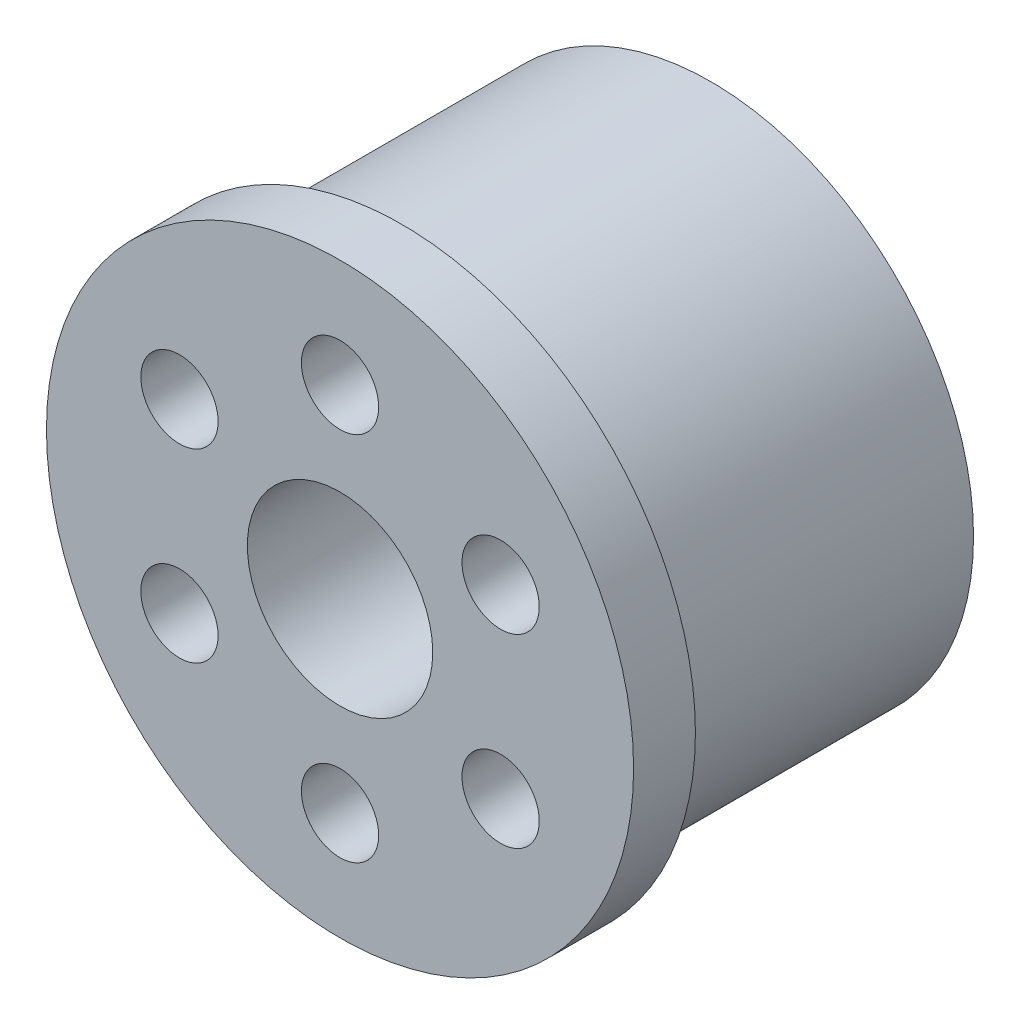
ISO-10303-21;
HEADER;
FILE_DESCRIPTION(('STEP AP214'),'2;1');
FILE_NAME('part.step','',(''),(''),'','','');
FILE_SCHEMA(('AUTOMOTIVE_DESIGN { 1 0 10303 214 1 1 1 1 }'));
ENDSEC;
DATA;
#1=APPLICATION_CONTEXT('core data for automotive mechanical design processes');
#2=APPLICATION_PROTOCOL_DEFINITION('international standard','automotive_design',2000,#1);
#3=PRODUCT_CONTEXT('',#1,'mechanical');
#4=PRODUCT('Part','Part','',(#3));
#5=PRODUCT_RELATED_PRODUCT_CATEGORY('part','',(#4));
#6=PRODUCT_DEFINITION_FORMATION('','',#4);
#7=PRODUCT_DEFINITION_CONTEXT('part definition',#1,'design');
#8=PRODUCT_DEFINITION('design','',#6,#7);
#9=PRODUCT_DEFINITION_SHAPE('','',#8);
#10=(LENGTH_UNIT() NAMED_UNIT(*) SI_UNIT(.MILLI.,.METRE.));
#11=(NAMED_UNIT(*) PLANE_ANGLE_UNIT() SI_UNIT($,.RADIAN.));
#12=(NAMED_UNIT(*) SI_UNIT($,.STERADIAN.) SOLID_ANGLE_UNIT());
#13=UNCERTAINTY_MEASURE_WITH_UNIT(LENGTH_MEASURE(1.E-05),#10,'distance_accuracy_value','');
#14=(GEOMETRIC_REPRESENTATION_CONTEXT(3) GLOBAL_UNCERTAINTY_ASSIGNED_CONTEXT((#13)) GLOBAL_UNIT_ASSIGNED_CONTEXT((#10,
#11,#12)) REPRESENTATION_CONTEXT('',''));
#15=CARTESIAN_POINT('',(0.,0.,0.));
#16=DIRECTION('',(0.,0.,1.));
#17=DIRECTION('',(1.,0.,0.));
#18=AXIS2_PLACEMENT_3D('',#15,#16,#17);
#19=CARTESIAN_POINT('',(0.,0.,6.));
#20=DIRECTION('',(0.,0.,-1.));
#21=DIRECTION('',(-1.,0.,0.));
#22=AXIS2_PLACEMENT_3D('',#19,#20,#21);
#23=CYLINDRICAL_SURFACE('',#22,7.5);
#24=CARTESIAN_POINT('',(0.,0.,-6.));
#25=DIRECTION('',(0.,0.,1.));
#26=DIRECTION('',(1.,0.,0.));
#27=AXIS2_PLACEMENT_3D('',#24,#25,#26);
#28=CIRCLE('',#27,7.5);
#29=CARTESIAN_POINT('',(7.5,0.,-6.));
#30=VERTEX_POINT('',#29);
#31=EDGE_CURVE('E57',#30,#30,#28,.T.);
#32=ORIENTED_EDGE('',*,*,#31,.F.);
#33=EDGE_LOOP('',(#32));
#34=FACE_BOUND('',#33,.T.);
#35=CARTESIAN_POINT('',(0.,0.,4.));
#36=DIRECTION('',(0.,0.,1.));
#37=DIRECTION('',(1.,0.,0.));
#38=AXIS2_PLACEMENT_3D('',#35,#36,#37);
#39=CIRCLE('',#38,7.5);
#40=CARTESIAN_POINT('',(7.5,0.,4.));
#41=VERTEX_POINT('',#40);
#42=EDGE_CURVE('E109',#41,#41,#39,.T.);
#43=ORIENTED_EDGE('',*,*,#42,.T.);
#44=EDGE_LOOP('',(#43));
#45=FACE_BOUND('',#44,.T.);
#46=ADVANCED_FACE('F45',(#34,#45),#23,.F.);
#47=CARTESIAN_POINT('',(0.,0.,6.));
#48=DIRECTION('',(0.,0.,-1.));
#49=DIRECTION('',(-1.,0.,0.));
#50=AXIS2_PLACEMENT_3D('',#47,#48,#49);
#51=CYLINDRICAL_SURFACE('',#50,8.5);
#52=CARTESIAN_POINT('',(0.,0.,-6.));
#53=DIRECTION('',(0.,0.,1.));
#54=DIRECTION('',(1.,0.,0.));
#55=AXIS2_PLACEMENT_3D('',#52,#53,#54);
#56=CIRCLE('',#55,8.5);
#57=CARTESIAN_POINT('',(8.5,0.,-6.));
#58=VERTEX_POINT('',#57);
#59=EDGE_CURVE('E52',#58,#58,#56,.T.);
#60=ORIENTED_EDGE('',*,*,#59,.T.);
#61=EDGE_LOOP('',(#60));
#62=FACE_BOUND('',#61,.T.);
#63=CARTESIAN_POINT('',(0.,0.,4.));
#64=DIRECTION('',(0.,0.,1.));
#65=DIRECTION('',(1.,0.,0.));
#66=AXIS2_PLACEMENT_3D('',#63,#64,#65);
#67=CIRCLE('',#66,8.5);
#68=CARTESIAN_POINT('',(8.5,0.,4.));
#69=VERTEX_POINT('',#68);
#70=EDGE_CURVE('E11',#69,#69,#67,.T.);
#71=ORIENTED_EDGE('',*,*,#70,.F.);
#72=EDGE_LOOP('',(#71));
#73=FACE_BOUND('',#72,.T.);
#74=ADVANCED_FACE('F125',(#62,#73),#51,.T.);
#75=CARTESIAN_POINT('',(0.,0.,6.));
#76=DIRECTION('',(0.,0.,1.));
#77=DIRECTION('',(1.,0.,0.));
#78=AXIS2_PLACEMENT_3D('',#75,#76,#77);
#79=PLANE('',#78);
#80=CARTESIAN_POINT('',(-5.1961524227066,-3.00000000000006,6.));
#81=DIRECTION('',(0.,0.,1.));
#82=DIRECTION('',(0.50000000000001,-0.866025403784433,0.));
#83=AXIS2_PLACEMENT_3D('',#80,#81,#82);
#84=CIRCLE('',#83,1.25);
#85=CARTESIAN_POINT('',(-4.57115242270658,-4.0825317547306,6.));
#86=VERTEX_POINT('',#85);
#87=EDGE_CURVE('E89',#86,#86,#84,.T.);
#88=ORIENTED_EDGE('',*,*,#87,.F.);
#89=EDGE_LOOP('',(#88));
#90=FACE_BOUND('',#89,.T.);
#91=CARTESIAN_POINT('',(-5.19615242270666,2.99999999999995,6.));
#92=DIRECTION('',(0.,0.,1.));
#93=DIRECTION('',(-0.499999999999992,-0.866025403784443,0.));
#94=AXIS2_PLACEMENT_3D('',#91,#92,#93);
#95=CIRCLE('',#94,1.25);
#96=CARTESIAN_POINT('',(-5.82115242270665,1.9174682452694,6.));
#97=VERTEX_POINT('',#96);
#98=EDGE_CURVE('E79',#97,#97,#95,.T.);
#99=ORIENTED_EDGE('',*,*,#98,.F.);
#100=EDGE_LOOP('',(#99));
#101=FACE_BOUND('',#100,.T.);
#102=CARTESIAN_POINT('',(0.,6.,6.));
#103=DIRECTION('',(0.,0.,1.));
#104=DIRECTION('',(-1.,0.,0.));
#105=AXIS2_PLACEMENT_3D('',#102,#103,#104);
#106=CIRCLE('',#105,1.25);
#107=CARTESIAN_POINT('',(-1.25,6.,6.));
#108=VERTEX_POINT('',#107);
#109=EDGE_CURVE('E76',#108,#108,#106,.T.);
#110=ORIENTED_EDGE('',*,*,#109,.F.);
#111=EDGE_LOOP('',(#110));
#112=FACE_BOUND('',#111,.T.);
#113=CARTESIAN_POINT('',(5.19615242270662,3.00000000000002,6.));
#114=DIRECTION('',(0.,0.,1.));
#115=DIRECTION('',(-0.500000000000004,0.866025403784436,0.));
#116=AXIS2_PLACEMENT_3D('',#113,#114,#115);
#117=CIRCLE('',#116,1.25);
#118=CARTESIAN_POINT('',(4.57115242270661,4.08253175473057,6.));
#119=VERTEX_POINT('',#118);
#120=EDGE_CURVE('E73',#119,#119,#117,.T.);
#121=ORIENTED_EDGE('',*,*,#120,.F.);
#122=EDGE_LOOP('',(#121));
#123=FACE_BOUND('',#122,.T.);
#124=CARTESIAN_POINT('',(5.19615242270664,-2.99999999999999,6.));
#125=DIRECTION('',(0.,0.,1.));
#126=DIRECTION('',(0.499999999999998,0.86602540378444,0.));
#127=AXIS2_PLACEMENT_3D('',#124,#125,#126);
#128=CIRCLE('',#127,1.25);
#129=CARTESIAN_POINT('',(5.82115242270664,-1.91746824526944,6.));
#130=VERTEX_POINT('',#129);
#131=EDGE_CURVE('E69',#130,#130,#128,.T.);
#132=ORIENTED_EDGE('',*,*,#131,.F.);
#133=EDGE_LOOP('',(#132));
#134=FACE_BOUND('',#133,.T.);
#135=CARTESIAN_POINT('',(0.,-6.,6.));
#136=DIRECTION('',(0.,0.,1.));
#137=DIRECTION('',(1.,0.,0.));
#138=AXIS2_PLACEMENT_3D('',#135,#136,#137);
#139=CIRCLE('',#138,1.25);
#140=CARTESIAN_POINT('',(1.25,-6.,6.));
#141=VERTEX_POINT('',#140);
#142=EDGE_CURVE('E65',#141,#141,#139,.T.);
#143=ORIENTED_EDGE('',*,*,#142,.F.);
#144=EDGE_LOOP('',(#143));
#145=FACE_BOUND('',#144,.T.);
#146=CARTESIAN_POINT('',(0.,0.,6.));
#147=DIRECTION('',(0.,0.,1.));
#148=DIRECTION('',(1.,0.,0.));
#149=AXIS2_PLACEMENT_3D('',#146,#147,#148);
#150=CIRCLE('',#149,9.5);
#151=CARTESIAN_POINT('',(9.5,0.,6.));
#152=VERTEX_POINT('',#151);
#153=EDGE_CURVE('E112',#152,#152,#150,.T.);
#154=ORIENTED_EDGE('',*,*,#153,.T.);
#155=EDGE_LOOP('',(#154));
#156=FACE_BOUND('',#155,.T.);
#157=CARTESIAN_POINT('',(0.,0.,6.));
#158=DIRECTION('',(0.,0.,1.));
#159=DIRECTION('',(1.,0.,0.));
#160=AXIS2_PLACEMENT_3D('',#157,#158,#159);
#161=CIRCLE('',#160,3.);
#162=CARTESIAN_POINT('',(3.,0.,6.));
#163=VERTEX_POINT('',#162);
#164=EDGE_CURVE('E98',#163,#163,#161,.T.);
#165=ORIENTED_EDGE('',*,*,#164,.F.);
#166=EDGE_LOOP('',(#165));
#167=FACE_BOUND('',#166,.T.);
#168=ADVANCED_FACE('F148',(#90,#101,#112,#123,#134,#145,#156,#167),#79,.T.);
#169=CARTESIAN_POINT('',(0.,0.,-6.));
#170=DIRECTION('',(0.,0.,1.));
#171=DIRECTION('',(1.,0.,0.));
#172=AXIS2_PLACEMENT_3D('',#169,#170,#171);
#173=PLANE('',#172);
#174=ORIENTED_EDGE('',*,*,#31,.T.);
#175=EDGE_LOOP('',(#174));
#176=FACE_BOUND('',#175,.T.);
#177=ORIENTED_EDGE('',*,*,#59,.F.);
#178=EDGE_LOOP('',(#177));
#179=FACE_BOUND('',#178,.T.);
#180=ADVANCED_FACE('F120',(#176,#179),#173,.F.);
#181=CARTESIAN_POINT('',(0.,0.,4.));
#182=DIRECTION('',(0.,0.,1.));
#183=DIRECTION('',(1.,0.,0.));
#184=AXIS2_PLACEMENT_3D('',#181,#182,#183);
#185=CYLINDRICAL_SURFACE('',#184,9.5);
#186=CARTESIAN_POINT('',(0.,0.,4.));
#187=DIRECTION('',(0.,0.,1.));
#188=DIRECTION('',(1.,0.,0.));
#189=AXIS2_PLACEMENT_3D('',#186,#187,#188);
#190=CIRCLE('',#189,9.5);
#191=CARTESIAN_POINT('',(9.5,0.,4.));
#192=VERTEX_POINT('',#191);
#193=EDGE_CURVE('E113',#192,#192,#190,.T.);
#194=ORIENTED_EDGE('',*,*,#193,.T.);
#195=EDGE_LOOP('',(#194));
#196=FACE_BOUND('',#195,.T.);
#197=ORIENTED_EDGE('',*,*,#153,.F.);
#198=EDGE_LOOP('',(#197));
#199=FACE_BOUND('',#198,.T.);
#200=ADVANCED_FACE('F141',(#196,#199),#185,.T.);
#201=CARTESIAN_POINT('',(0.,0.,4.));
#202=DIRECTION('',(0.,0.,1.));
#203=DIRECTION('',(1.,0.,0.));
#204=AXIS2_PLACEMENT_3D('',#201,#202,#203);
#205=PLANE('',#204);
#206=ORIENTED_EDGE('',*,*,#70,.T.);
#207=EDGE_LOOP('',(#206));
#208=FACE_BOUND('',#207,.T.);
#209=ORIENTED_EDGE('',*,*,#193,.F.);
#210=EDGE_LOOP('',(#209));
#211=FACE_BOUND('',#210,.T.);
#212=ADVANCED_FACE('F131',(#208,#211),#205,.F.);
#213=CARTESIAN_POINT('',(0.,0.,4.));
#214=DIRECTION('',(0.,0.,1.));
#215=DIRECTION('',(1.,0.,0.));
#216=AXIS2_PLACEMENT_3D('',#213,#214,#215);
#217=PLANE('',#216);
#218=CARTESIAN_POINT('',(-5.1961524227066,-3.00000000000006,4.));
#219=DIRECTION('',(0.,0.,1.));
#220=DIRECTION('',(1.,0.,0.));
#221=AXIS2_PLACEMENT_3D('',#218,#219,#220);
#222=CIRCLE('',#221,1.25);
#223=CARTESIAN_POINT('',(-3.9461524227066,-3.00000000000006,4.));
#224=VERTEX_POINT('',#223);
#225=EDGE_CURVE('E48',#224,#224,#222,.T.);
#226=ORIENTED_EDGE('',*,*,#225,.T.);
#227=EDGE_LOOP('',(#226));
#228=FACE_BOUND('',#227,.T.);
#229=CARTESIAN_POINT('',(-5.19615242270666,2.99999999999995,4.));
#230=DIRECTION('',(0.,0.,1.));
#231=DIRECTION('',(1.,0.,0.));
#232=AXIS2_PLACEMENT_3D('',#229,#230,#231);
#233=CIRCLE('',#232,1.25);
#234=CARTESIAN_POINT('',(-3.94615242270666,2.99999999999995,4.));
#235=VERTEX_POINT('',#234);
#236=EDGE_CURVE('E77',#235,#235,#233,.T.);
#237=ORIENTED_EDGE('',*,*,#236,.T.);
#238=EDGE_LOOP('',(#237));
#239=FACE_BOUND('',#238,.T.);
#240=CARTESIAN_POINT('',(0.,6.,4.));
#241=DIRECTION('',(0.,0.,1.));
#242=DIRECTION('',(1.,0.,0.));
#243=AXIS2_PLACEMENT_3D('',#240,#241,#242);
#244=CIRCLE('',#243,1.25);
#245=CARTESIAN_POINT('',(1.25,6.,4.));
#246=VERTEX_POINT('',#245);
#247=EDGE_CURVE('E74',#246,#246,#244,.T.);
#248=ORIENTED_EDGE('',*,*,#247,.T.);
#249=EDGE_LOOP('',(#248));
#250=FACE_BOUND('',#249,.T.);
#251=CARTESIAN_POINT('',(5.19615242270662,3.00000000000002,4.));
#252=DIRECTION('',(0.,0.,1.));
#253=DIRECTION('',(1.,0.,0.));
#254=AXIS2_PLACEMENT_3D('',#251,#252,#253);
#255=CIRCLE('',#254,1.25);
#256=CARTESIAN_POINT('',(6.44615242270662,3.00000000000002,4.));
#257=VERTEX_POINT('',#256);
#258=EDGE_CURVE('E70',#257,#257,#255,.T.);
#259=ORIENTED_EDGE('',*,*,#258,.T.);
#260=EDGE_LOOP('',(#259));
#261=FACE_BOUND('',#260,.T.);
#262=CARTESIAN_POINT('',(5.19615242270664,-2.99999999999999,4.));
#263=DIRECTION('',(0.,0.,1.));
#264=DIRECTION('',(1.,0.,0.));
#265=AXIS2_PLACEMENT_3D('',#262,#263,#264);
#266=CIRCLE('',#265,1.25);
#267=CARTESIAN_POINT('',(6.44615242270664,-2.99999999999999,4.));
#268=VERTEX_POINT('',#267);
#269=EDGE_CURVE('E66',#268,#268,#266,.T.);
#270=ORIENTED_EDGE('',*,*,#269,.T.);
#271=EDGE_LOOP('',(#270));
#272=FACE_BOUND('',#271,.T.);
#273=CARTESIAN_POINT('',(0.,-6.,4.));
#274=DIRECTION('',(0.,0.,1.));
#275=DIRECTION('',(1.,0.,0.));
#276=AXIS2_PLACEMENT_3D('',#273,#274,#275);
#277=CIRCLE('',#276,1.25);
#278=CARTESIAN_POINT('',(1.25,-6.,4.));
#279=VERTEX_POINT('',#278);
#280=EDGE_CURVE('E61',#279,#279,#277,.T.);
#281=ORIENTED_EDGE('',*,*,#280,.T.);
#282=EDGE_LOOP('',(#281));
#283=FACE_BOUND('',#282,.T.);
#284=CARTESIAN_POINT('',(0.,0.,4.));
#285=DIRECTION('',(0.,0.,1.));
#286=DIRECTION('',(1.,0.,0.));
#287=AXIS2_PLACEMENT_3D('',#284,#285,#286);
#288=CIRCLE('',#287,4.5);
#289=CARTESIAN_POINT('',(4.5,0.,4.));
#290=VERTEX_POINT('',#289);
#291=EDGE_CURVE('E101',#290,#290,#288,.F.);
#292=ORIENTED_EDGE('',*,*,#291,.F.);
#293=EDGE_LOOP('',(#292));
#294=FACE_BOUND('',#293,.T.);
#295=ORIENTED_EDGE('',*,*,#42,.F.);
#296=EDGE_LOOP('',(#295));
#297=FACE_BOUND('',#296,.T.);
#298=ADVANCED_FACE('F128',(#228,#239,#250,#261,#272,#283,#294,#297),#217,.F.);
#299=CARTESIAN_POINT('',(0.,0.,6.));
#300=DIRECTION('',(0.,0.,-1.));
#301=DIRECTION('',(-1.,0.,0.));
#302=AXIS2_PLACEMENT_3D('',#299,#300,#301);
#303=CYLINDRICAL_SURFACE('',#302,4.5);
#304=CARTESIAN_POINT('',(0.,0.,-6.));
#305=DIRECTION('',(0.,0.,1.));
#306=DIRECTION('',(1.,0.,0.));
#307=AXIS2_PLACEMENT_3D('',#304,#305,#306);
#308=CIRCLE('',#307,4.5);
#309=CARTESIAN_POINT('',(4.5,0.,-6.));
#310=VERTEX_POINT('',#309);
#311=EDGE_CURVE('E102',#310,#310,#308,.T.);
#312=ORIENTED_EDGE('',*,*,#311,.T.);
#313=EDGE_LOOP('',(#312));
#314=FACE_BOUND('',#313,.T.);
#315=ORIENTED_EDGE('',*,*,#291,.T.);
#316=EDGE_LOOP('',(#315));
#317=FACE_BOUND('',#316,.T.);
#318=ADVANCED_FACE('F130',(#314,#317),#303,.T.);
#319=CARTESIAN_POINT('',(0.,0.,6.));
#320=DIRECTION('',(0.,0.,-1.));
#321=DIRECTION('',(-1.,0.,0.));
#322=AXIS2_PLACEMENT_3D('',#319,#320,#321);
#323=CYLINDRICAL_SURFACE('',#322,3.);
#324=ORIENTED_EDGE('',*,*,#164,.T.);
#325=EDGE_LOOP('',(#324));
#326=FACE_BOUND('',#325,.T.);
#327=CARTESIAN_POINT('',(0.,0.,-6.));
#328=DIRECTION('',(0.,0.,1.));
#329=DIRECTION('',(1.,0.,0.));
#330=AXIS2_PLACEMENT_3D('',#327,#328,#329);
#331=CIRCLE('',#330,3.);
#332=CARTESIAN_POINT('',(3.,0.,-6.));
#333=VERTEX_POINT('',#332);
#334=EDGE_CURVE('E64',#333,#333,#331,.T.);
#335=ORIENTED_EDGE('',*,*,#334,.F.);
#336=EDGE_LOOP('',(#335));
#337=FACE_BOUND('',#336,.T.);
#338=ADVANCED_FACE('F138',(#326,#337),#323,.F.);
#339=CARTESIAN_POINT('',(0.,0.,-6.));
#340=DIRECTION('',(0.,0.,1.));
#341=DIRECTION('',(1.,0.,0.));
#342=AXIS2_PLACEMENT_3D('',#339,#340,#341);
#343=PLANE('',#342);
#344=ORIENTED_EDGE('',*,*,#334,.T.);
#345=EDGE_LOOP('',(#344));
#346=FACE_BOUND('',#345,.T.);
#347=ORIENTED_EDGE('',*,*,#311,.F.);
#348=EDGE_LOOP('',(#347));
#349=FACE_BOUND('',#348,.T.);
#350=ADVANCED_FACE('F195',(#346,#349),#343,.F.);
#351=CARTESIAN_POINT('',(0.,-6.,-6.));
#352=DIRECTION('',(0.,0.,1.));
#353=DIRECTION('',(1.,0.,0.));
#354=AXIS2_PLACEMENT_3D('',#351,#352,#353);
#355=CYLINDRICAL_SURFACE('',#354,1.25);
#356=ORIENTED_EDGE('',*,*,#142,.T.);
#357=EDGE_LOOP('',(#356));
#358=FACE_BOUND('',#357,.T.);
#359=ORIENTED_EDGE('',*,*,#280,.F.);
#360=EDGE_LOOP('',(#359));
#361=FACE_BOUND('',#360,.T.);
#362=ADVANCED_FACE('F203',(#358,#361),#355,.F.);
#363=CARTESIAN_POINT('',(5.19615242270664,-2.99999999999999,-6.));
#364=DIRECTION('',(0.,0.,1.));
#365=DIRECTION('',(1.,0.,0.));
#366=AXIS2_PLACEMENT_3D('',#363,#364,#365);
#367=CYLINDRICAL_SURFACE('',#366,1.25);
#368=ORIENTED_EDGE('',*,*,#131,.T.);
#369=EDGE_LOOP('',(#368));
#370=FACE_BOUND('',#369,.T.);
#371=ORIENTED_EDGE('',*,*,#269,.F.);
#372=EDGE_LOOP('',(#371));
#373=FACE_BOUND('',#372,.T.);
#374=ADVANCED_FACE('F213',(#370,#373),#367,.F.);
#375=CARTESIAN_POINT('',(5.19615242270662,3.00000000000002,-6.));
#376=DIRECTION('',(0.,0.,1.));
#377=DIRECTION('',(1.,0.,0.));
#378=AXIS2_PLACEMENT_3D('',#375,#376,#377);
#379=CYLINDRICAL_SURFACE('',#378,1.25);
#380=ORIENTED_EDGE('',*,*,#120,.T.);
#381=EDGE_LOOP('',(#380));
#382=FACE_BOUND('',#381,.T.);
#383=ORIENTED_EDGE('',*,*,#258,.F.);
#384=EDGE_LOOP('',(#383));
#385=FACE_BOUND('',#384,.T.);
#386=ADVANCED_FACE('F224',(#382,#385),#379,.F.);
#387=CARTESIAN_POINT('',(0.,6.,-6.));
#388=DIRECTION('',(0.,0.,1.));
#389=DIRECTION('',(1.,0.,0.));
#390=AXIS2_PLACEMENT_3D('',#387,#388,#389);
#391=CYLINDRICAL_SURFACE('',#390,1.25);
#392=ORIENTED_EDGE('',*,*,#109,.T.);
#393=EDGE_LOOP('',(#392));
#394=FACE_BOUND('',#393,.T.);
#395=ORIENTED_EDGE('',*,*,#247,.F.);
#396=EDGE_LOOP('',(#395));
#397=FACE_BOUND('',#396,.T.);
#398=ADVANCED_FACE('F231',(#394,#397),#391,.F.);
#399=CARTESIAN_POINT('',(-5.19615242270666,2.99999999999995,-6.));
#400=DIRECTION('',(0.,0.,1.));
#401=DIRECTION('',(1.,0.,0.));
#402=AXIS2_PLACEMENT_3D('',#399,#400,#401);
#403=CYLINDRICAL_SURFACE('',#402,1.25);
#404=ORIENTED_EDGE('',*,*,#98,.T.);
#405=EDGE_LOOP('',(#404));
#406=FACE_BOUND('',#405,.T.);
#407=ORIENTED_EDGE('',*,*,#236,.F.);
#408=EDGE_LOOP('',(#407));
#409=FACE_BOUND('',#408,.T.);
#410=ADVANCED_FACE('F239',(#406,#409),#403,.F.);
#411=CARTESIAN_POINT('',(-5.1961524227066,-3.00000000000006,-6.));
#412=DIRECTION('',(0.,0.,1.));
#413=DIRECTION('',(1.,0.,0.));
#414=AXIS2_PLACEMENT_3D('',#411,#412,#413);
#415=CYLINDRICAL_SURFACE('',#414,1.25);
#416=ORIENTED_EDGE('',*,*,#87,.T.);
#417=EDGE_LOOP('',(#416));
#418=FACE_BOUND('',#417,.T.);
#419=ORIENTED_EDGE('',*,*,#225,.F.);
#420=EDGE_LOOP('',(#419));
#421=FACE_BOUND('',#420,.T.);
#422=ADVANCED_FACE('F247',(#418,#421),#415,.F.);
#423=CLOSED_SHELL('',(#46,#74,#168,#180,#200,#212,#298,#318,#338,#350,#362,#374,#386,#398,#410,#422));
#424=MANIFOLD_SOLID_BREP('B2',#423);
#425=ADVANCED_BREP_SHAPE_REPRESENTATION('',(#18,#424),#14);
#426=SHAPE_DEFINITION_REPRESENTATION(#9,#425);
ENDSEC;
END-ISO-10303-21;
